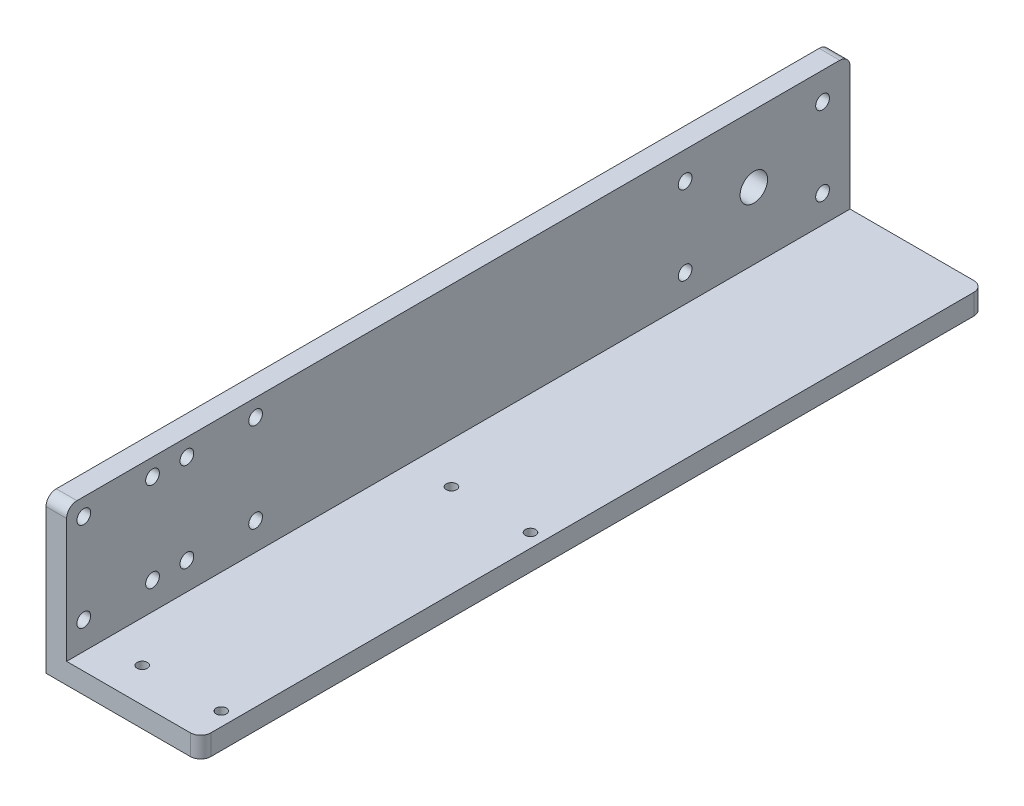
ISO-10303-21;
HEADER;
FILE_DESCRIPTION(('STEP AP214'),'2;1');
FILE_NAME('part.step','',(''),(''),'','','');
FILE_SCHEMA(('AUTOMOTIVE_DESIGN { 1 0 10303 214 1 1 1 1 }'));
ENDSEC;
DATA;
#1=APPLICATION_CONTEXT('core data for automotive mechanical design processes');
#2=APPLICATION_PROTOCOL_DEFINITION('international standard','automotive_design',2000,#1);
#3=PRODUCT_CONTEXT('',#1,'mechanical');
#4=PRODUCT('Part','Part','',(#3));
#5=PRODUCT_RELATED_PRODUCT_CATEGORY('part','',(#4));
#6=PRODUCT_DEFINITION_FORMATION('','',#4);
#7=PRODUCT_DEFINITION_CONTEXT('part definition',#1,'design');
#8=PRODUCT_DEFINITION('design','',#6,#7);
#9=PRODUCT_DEFINITION_SHAPE('','',#8);
#10=(LENGTH_UNIT() NAMED_UNIT(*) SI_UNIT(.MILLI.,.METRE.));
#11=(NAMED_UNIT(*) PLANE_ANGLE_UNIT() SI_UNIT($,.RADIAN.));
#12=(NAMED_UNIT(*) SI_UNIT($,.STERADIAN.) SOLID_ANGLE_UNIT());
#13=UNCERTAINTY_MEASURE_WITH_UNIT(LENGTH_MEASURE(1.E-05),#10,'distance_accuracy_value','');
#14=(GEOMETRIC_REPRESENTATION_CONTEXT(3) GLOBAL_UNCERTAINTY_ASSIGNED_CONTEXT((#13)) GLOBAL_UNIT_ASSIGNED_CONTEXT((#10,
#11,#12)) REPRESENTATION_CONTEXT('',''));
#15=CARTESIAN_POINT('',(0.,0.,0.));
#16=DIRECTION('',(0.,0.,1.));
#17=DIRECTION('',(1.,0.,0.));
#18=AXIS2_PLACEMENT_3D('',#15,#16,#17);
#19=CARTESIAN_POINT('',(76.9692086330936,26.8,228.));
#20=DIRECTION('',(0.,-1.,0.));
#21=DIRECTION('',(0.,0.,-1.));
#22=AXIS2_PLACEMENT_3D('',#19,#20,#21);
#23=PLANE('',#22);
#24=DIRECTION('',(0.,0.,-1.));
#25=VECTOR('',#24,1.);
#26=CARTESIAN_POINT('',(82.9692086330936,26.8,228.));
#27=LINE('',#26,#25);
#28=CARTESIAN_POINT('',(82.9692086330936,26.8,225.));
#29=VERTEX_POINT('',#28);
#30=CARTESIAN_POINT('',(82.9692086330936,26.8,3.00000000000006));
#31=VERTEX_POINT('',#30);
#32=EDGE_CURVE('E160',#29,#31,#27,.T.);
#33=ORIENTED_EDGE('',*,*,#32,.T.);
#34=DIRECTION('',(-1.,0.,0.));
#35=VECTOR('',#34,1.);
#36=CARTESIAN_POINT('',(76.9692086330936,26.8,3.));
#37=LINE('',#36,#35);
#38=CARTESIAN_POINT('',(76.9692086330936,26.8,3.00000000000006));
#39=VERTEX_POINT('',#38);
#40=EDGE_CURVE('E198',#31,#39,#37,.T.);
#41=ORIENTED_EDGE('',*,*,#40,.T.);
#42=DIRECTION('',(0.,0.,-1.));
#43=VECTOR('',#42,1.);
#44=CARTESIAN_POINT('',(76.9692086330936,26.8,228.));
#45=LINE('',#44,#43);
#46=CARTESIAN_POINT('',(76.9692086330936,26.8,225.));
#47=VERTEX_POINT('',#46);
#48=EDGE_CURVE('E146',#47,#39,#45,.T.);
#49=ORIENTED_EDGE('',*,*,#48,.F.);
#50=DIRECTION('',(-1.,0.,0.));
#51=VECTOR('',#50,1.);
#52=CARTESIAN_POINT('',(76.9692086330936,26.8,225.));
#53=LINE('',#52,#51);
#54=EDGE_CURVE('E66',#47,#29,#53,.F.);
#55=ORIENTED_EDGE('',*,*,#54,.T.);
#56=EDGE_LOOP('',(#33,#41,#49,#55));
#57=FACE_BOUND('',#56,.T.);
#58=ADVANCED_FACE('F44',(#57),#23,.F.);
#59=CARTESIAN_POINT('',(76.9692086330936,-12.2,228.));
#60=DIRECTION('',(1.,0.,0.));
#61=DIRECTION('',(0.,0.,-1.));
#62=AXIS2_PLACEMENT_3D('',#59,#60,#61);
#63=PLANE('',#62);
#64=CARTESIAN_POINT('',(76.9692086330936,7.30000000000002,28.));
#65=DIRECTION('',(-1.,0.,0.));
#66=DIRECTION('',(0.,-1.,0.));
#67=AXIS2_PLACEMENT_3D('',#64,#65,#66);
#68=CIRCLE('',#67,4.);
#69=CARTESIAN_POINT('',(76.9692086330936,3.30000000000002,28.));
#70=VERTEX_POINT('',#69);
#71=EDGE_CURVE('E430',#70,#70,#68,.T.);
#72=ORIENTED_EDGE('',*,*,#71,.F.);
#73=EDGE_LOOP('',(#72));
#74=FACE_BOUND('',#73,.T.);
#75=CARTESIAN_POINT('',(76.9692086330936,18.8,48.));
#76=DIRECTION('',(-1.,0.,0.));
#77=DIRECTION('',(0.,-1.,0.));
#78=AXIS2_PLACEMENT_3D('',#75,#76,#77);
#79=CIRCLE('',#78,2.);
#80=CARTESIAN_POINT('',(76.9692086330936,16.8,48.));
#81=VERTEX_POINT('',#80);
#82=EDGE_CURVE('E439',#81,#81,#79,.T.);
#83=ORIENTED_EDGE('',*,*,#82,.F.);
#84=EDGE_LOOP('',(#83));
#85=FACE_BOUND('',#84,.T.);
#86=CARTESIAN_POINT('',(76.9692086330936,-4.19999999999999,8.00000000000001));
#87=DIRECTION('',(-1.,0.,0.));
#88=DIRECTION('',(0.,-1.,0.));
#89=AXIS2_PLACEMENT_3D('',#86,#87,#88);
#90=CIRCLE('',#89,2.);
#91=CARTESIAN_POINT('',(76.9692086330936,-6.19999999999999,8.00000000000001));
#92=VERTEX_POINT('',#91);
#93=EDGE_CURVE('E438',#92,#92,#90,.T.);
#94=ORIENTED_EDGE('',*,*,#93,.F.);
#95=EDGE_LOOP('',(#94));
#96=FACE_BOUND('',#95,.T.);
#97=CARTESIAN_POINT('',(76.9692086330936,-4.19999999999999,48.));
#98=DIRECTION('',(-1.,0.,0.));
#99=DIRECTION('',(0.,-1.,0.));
#100=AXIS2_PLACEMENT_3D('',#97,#98,#99);
#101=CIRCLE('',#100,2.);
#102=CARTESIAN_POINT('',(76.9692086330936,-6.19999999999999,48.));
#103=VERTEX_POINT('',#102);
#104=EDGE_CURVE('E435',#103,#103,#101,.T.);
#105=ORIENTED_EDGE('',*,*,#104,.F.);
#106=EDGE_LOOP('',(#105));
#107=FACE_BOUND('',#106,.T.);
#108=CARTESIAN_POINT('',(76.9692086330936,18.8,8.00000000000001));
#109=DIRECTION('',(-1.,0.,0.));
#110=DIRECTION('',(0.,-1.,0.));
#111=AXIS2_PLACEMENT_3D('',#108,#109,#110);
#112=CIRCLE('',#111,2.);
#113=CARTESIAN_POINT('',(76.9692086330936,16.8,8.00000000000001));
#114=VERTEX_POINT('',#113);
#115=EDGE_CURVE('E236',#114,#114,#112,.T.);
#116=ORIENTED_EDGE('',*,*,#115,.F.);
#117=EDGE_LOOP('',(#116));
#118=FACE_BOUND('',#117,.T.);
#119=CARTESIAN_POINT('',(76.9692086330936,-4.19999999999999,173.));
#120=DIRECTION('',(1.,0.,0.));
#121=DIRECTION('',(0.,-1.,0.));
#122=AXIS2_PLACEMENT_3D('',#119,#120,#121);
#123=CIRCLE('',#122,2.);
#124=CARTESIAN_POINT('',(76.9692086330936,-6.19999999999998,173.));
#125=VERTEX_POINT('',#124);
#126=EDGE_CURVE('E252',#125,#125,#123,.T.);
#127=ORIENTED_EDGE('',*,*,#126,.T.);
#128=EDGE_LOOP('',(#127));
#129=FACE_BOUND('',#128,.T.);
#130=CARTESIAN_POINT('',(76.9692086330936,21.8,193.));
#131=DIRECTION('',(1.,0.,0.));
#132=DIRECTION('',(0.,-1.,0.));
#133=AXIS2_PLACEMENT_3D('',#130,#131,#132);
#134=CIRCLE('',#133,2.);
#135=CARTESIAN_POINT('',(76.9692086330936,19.8,193.));
#136=VERTEX_POINT('',#135);
#137=EDGE_CURVE('E247',#136,#136,#134,.T.);
#138=ORIENTED_EDGE('',*,*,#137,.T.);
#139=EDGE_LOOP('',(#138));
#140=FACE_BOUND('',#139,.T.);
#141=CARTESIAN_POINT('',(76.9692086330936,-4.19999999999999,193.));
#142=DIRECTION('',(1.,0.,0.));
#143=DIRECTION('',(0.,-1.,0.));
#144=AXIS2_PLACEMENT_3D('',#141,#142,#143);
#145=CIRCLE('',#144,2.);
#146=CARTESIAN_POINT('',(76.9692086330936,-6.19999999999998,193.));
#147=VERTEX_POINT('',#146);
#148=EDGE_CURVE('E243',#147,#147,#145,.T.);
#149=ORIENTED_EDGE('',*,*,#148,.T.);
#150=EDGE_LOOP('',(#149));
#151=FACE_BOUND('',#150,.T.);
#152=CARTESIAN_POINT('',(76.9692086330936,21.8,173.));
#153=DIRECTION('',(1.,0.,0.));
#154=DIRECTION('',(0.,-1.,0.));
#155=AXIS2_PLACEMENT_3D('',#152,#153,#154);
#156=CIRCLE('',#155,2.);
#157=CARTESIAN_POINT('',(76.9692086330936,19.8,173.));
#158=VERTEX_POINT('',#157);
#159=EDGE_CURVE('E222',#158,#158,#156,.T.);
#160=ORIENTED_EDGE('',*,*,#159,.T.);
#161=EDGE_LOOP('',(#160));
#162=FACE_BOUND('',#161,.T.);
#163=CARTESIAN_POINT('',(76.9692086330936,-4.19999999999999,223.));
#164=DIRECTION('',(-1.,0.,0.));
#165=DIRECTION('',(0.,-1.,0.));
#166=AXIS2_PLACEMENT_3D('',#163,#164,#165);
#167=CIRCLE('',#166,2.);
#168=CARTESIAN_POINT('',(76.9692086330936,-6.19999999999998,223.));
#169=VERTEX_POINT('',#168);
#170=EDGE_CURVE('E264',#169,#169,#167,.T.);
#171=ORIENTED_EDGE('',*,*,#170,.F.);
#172=EDGE_LOOP('',(#171));
#173=FACE_BOUND('',#172,.T.);
#174=CARTESIAN_POINT('',(76.9692086330936,21.8,203.));
#175=DIRECTION('',(-1.,0.,0.));
#176=DIRECTION('',(0.,-1.,0.));
#177=AXIS2_PLACEMENT_3D('',#174,#175,#176);
#178=CIRCLE('',#177,2.);
#179=CARTESIAN_POINT('',(76.9692086330936,19.8,203.));
#180=VERTEX_POINT('',#179);
#181=EDGE_CURVE('E263',#180,#180,#178,.T.);
#182=ORIENTED_EDGE('',*,*,#181,.F.);
#183=EDGE_LOOP('',(#182));
#184=FACE_BOUND('',#183,.T.);
#185=CARTESIAN_POINT('',(76.9692086330936,-4.19999999999999,203.));
#186=DIRECTION('',(-1.,0.,0.));
#187=DIRECTION('',(0.,-1.,0.));
#188=AXIS2_PLACEMENT_3D('',#185,#186,#187);
#189=CIRCLE('',#188,2.);
#190=CARTESIAN_POINT('',(76.9692086330936,-6.19999999999998,203.));
#191=VERTEX_POINT('',#190);
#192=EDGE_CURVE('E231',#191,#191,#189,.T.);
#193=ORIENTED_EDGE('',*,*,#192,.F.);
#194=EDGE_LOOP('',(#193));
#195=FACE_BOUND('',#194,.T.);
#196=CARTESIAN_POINT('',(76.9692086330936,21.8,223.));
#197=DIRECTION('',(-1.,0.,0.));
#198=DIRECTION('',(0.,-1.,0.));
#199=AXIS2_PLACEMENT_3D('',#196,#197,#198);
#200=CIRCLE('',#199,2.);
#201=CARTESIAN_POINT('',(76.9692086330936,19.8,223.));
#202=VERTEX_POINT('',#201);
#203=EDGE_CURVE('E210',#202,#202,#200,.T.);
#204=ORIENTED_EDGE('',*,*,#203,.F.);
#205=EDGE_LOOP('',(#204));
#206=FACE_BOUND('',#205,.T.);
#207=ORIENTED_EDGE('',*,*,#48,.T.);
#208=CARTESIAN_POINT('',(76.9692086330936,23.8,3.));
#209=DIRECTION('',(1.,0.,0.));
#210=DIRECTION('',(0.,0.,-1.));
#211=AXIS2_PLACEMENT_3D('',#208,#209,#210);
#212=CIRCLE('',#211,3.);
#213=CARTESIAN_POINT('',(76.9692086330936,23.8,0.));
#214=VERTEX_POINT('',#213);
#215=EDGE_CURVE('E203',#39,#214,#212,.F.);
#216=ORIENTED_EDGE('',*,*,#215,.T.);
#217=DIRECTION('',(0.,-1.,0.));
#218=VECTOR('',#217,1.);
#219=CARTESIAN_POINT('',(76.9692086330936,-12.2,0.));
#220=LINE('',#219,#218);
#221=CARTESIAN_POINT('',(76.9692086330936,-18.2,0.));
#222=VERTEX_POINT('',#221);
#223=EDGE_CURVE('E142',#214,#222,#220,.T.);
#224=ORIENTED_EDGE('',*,*,#223,.T.);
#225=DIRECTION('',(0.,0.,-1.));
#226=VECTOR('',#225,1.);
#227=CARTESIAN_POINT('',(76.9692086330936,-18.2,228.));
#228=LINE('',#227,#226);
#229=CARTESIAN_POINT('',(76.9692086330936,-18.2,228.));
#230=VERTEX_POINT('',#229);
#231=EDGE_CURVE('E138',#230,#222,#228,.T.);
#232=ORIENTED_EDGE('',*,*,#231,.F.);
#233=DIRECTION('',(0.,-1.,0.));
#234=VECTOR('',#233,1.);
#235=CARTESIAN_POINT('',(76.9692086330936,-12.2,228.));
#236=LINE('',#235,#234);
#237=CARTESIAN_POINT('',(76.9692086330936,23.8,228.));
#238=VERTEX_POINT('',#237);
#239=EDGE_CURVE('E124',#238,#230,#236,.T.);
#240=ORIENTED_EDGE('',*,*,#239,.F.);
#241=CARTESIAN_POINT('',(76.9692086330936,23.8,225.));
#242=DIRECTION('',(1.,0.,0.));
#243=DIRECTION('',(0.,0.,-1.));
#244=AXIS2_PLACEMENT_3D('',#241,#242,#243);
#245=CIRCLE('',#244,3.);
#246=EDGE_CURVE('E201',#238,#47,#245,.F.);
#247=ORIENTED_EDGE('',*,*,#246,.T.);
#248=EDGE_LOOP('',(#207,#216,#224,#232,#240,#247));
#249=FACE_BOUND('',#248,.T.);
#250=ADVANCED_FACE('F140',(#74,#85,#96,#107,#118,#129,#140,#151,#162,#173,#184,#195,#206,#249),
#63,.F.);
#251=CARTESIAN_POINT('',(82.9692086330936,-18.2,228.));
#252=DIRECTION('',(0.,1.,0.));
#253=DIRECTION('',(0.,0.,1.));
#254=AXIS2_PLACEMENT_3D('',#251,#252,#253);
#255=PLANE('',#254);
#256=CARTESIAN_POINT('',(94.9692086330936,-18.2,128.));
#257=DIRECTION('',(0.,1.,0.));
#258=DIRECTION('',(-1.,0.,0.));
#259=AXIS2_PLACEMENT_3D('',#256,#257,#258);
#260=CIRCLE('',#259,1.5);
#261=CARTESIAN_POINT('',(93.4692086330936,-18.2,128.));
#262=VERTEX_POINT('',#261);
#263=EDGE_CURVE('E421',#262,#262,#260,.T.);
#264=ORIENTED_EDGE('',*,*,#263,.T.);
#265=EDGE_LOOP('',(#264));
#266=FACE_BOUND('',#265,.T.);
#267=CARTESIAN_POINT('',(117.969208633094,-18.2,128.));
#268=DIRECTION('',(0.,1.,0.));
#269=DIRECTION('',(-1.,0.,0.));
#270=AXIS2_PLACEMENT_3D('',#267,#268,#269);
#271=CIRCLE('',#270,1.5);
#272=CARTESIAN_POINT('',(116.469208633094,-18.2,128.));
#273=VERTEX_POINT('',#272);
#274=EDGE_CURVE('E411',#273,#273,#271,.T.);
#275=ORIENTED_EDGE('',*,*,#274,.T.);
#276=EDGE_LOOP('',(#275));
#277=FACE_BOUND('',#276,.T.);
#278=CARTESIAN_POINT('',(117.969208633094,-18.2,218.));
#279=DIRECTION('',(0.,1.,0.));
#280=DIRECTION('',(-1.,0.,0.));
#281=AXIS2_PLACEMENT_3D('',#278,#279,#280);
#282=CIRCLE('',#281,1.5);
#283=CARTESIAN_POINT('',(116.469208633094,-18.2,218.));
#284=VERTEX_POINT('',#283);
#285=EDGE_CURVE('E406',#284,#284,#282,.T.);
#286=ORIENTED_EDGE('',*,*,#285,.T.);
#287=EDGE_LOOP('',(#286));
#288=FACE_BOUND('',#287,.T.);
#289=CARTESIAN_POINT('',(94.9692086330936,-18.2,218.));
#290=DIRECTION('',(0.,1.,0.));
#291=DIRECTION('',(-1.,0.,0.));
#292=AXIS2_PLACEMENT_3D('',#289,#290,#291);
#293=CIRCLE('',#292,1.5);
#294=CARTESIAN_POINT('',(93.4692086330936,-18.2,218.));
#295=VERTEX_POINT('',#294);
#296=EDGE_CURVE('E427',#295,#295,#293,.T.);
#297=ORIENTED_EDGE('',*,*,#296,.T.);
#298=EDGE_LOOP('',(#297));
#299=FACE_BOUND('',#298,.T.);
#300=DIRECTION('',(1.,0.,0.));
#301=VECTOR('',#300,1.);
#302=CARTESIAN_POINT('',(82.9692086330936,-18.2,0.));
#303=LINE('',#302,#301);
#304=CARTESIAN_POINT('',(118.969208633094,-18.2,0.));
#305=VERTEX_POINT('',#304);
#306=EDGE_CURVE('E162',#222,#305,#303,.T.);
#307=ORIENTED_EDGE('',*,*,#306,.T.);
#308=CARTESIAN_POINT('',(118.969208633094,-18.2,3.));
#309=DIRECTION('',(0.,1.,0.));
#310=DIRECTION('',(0.,0.,1.));
#311=AXIS2_PLACEMENT_3D('',#308,#309,#310);
#312=CIRCLE('',#311,3.);
#313=CARTESIAN_POINT('',(121.969208633094,-18.2,3.00000000000006));
#314=VERTEX_POINT('',#313);
#315=EDGE_CURVE('E192',#305,#314,#312,.F.);
#316=ORIENTED_EDGE('',*,*,#315,.T.);
#317=DIRECTION('',(0.,0.,-1.));
#318=VECTOR('',#317,1.);
#319=CARTESIAN_POINT('',(121.969208633094,-18.2,228.));
#320=LINE('',#319,#318);
#321=CARTESIAN_POINT('',(121.969208633094,-18.2,225.));
#322=VERTEX_POINT('',#321);
#323=EDGE_CURVE('E147',#322,#314,#320,.T.);
#324=ORIENTED_EDGE('',*,*,#323,.F.);
#325=CARTESIAN_POINT('',(118.969208633094,-18.2,225.));
#326=DIRECTION('',(0.,1.,0.));
#327=DIRECTION('',(0.,0.,1.));
#328=AXIS2_PLACEMENT_3D('',#325,#326,#327);
#329=CIRCLE('',#328,3.);
#330=CARTESIAN_POINT('',(118.969208633094,-18.2,228.));
#331=VERTEX_POINT('',#330);
#332=EDGE_CURVE('E152',#322,#331,#329,.F.);
#333=ORIENTED_EDGE('',*,*,#332,.T.);
#334=DIRECTION('',(1.,0.,0.));
#335=VECTOR('',#334,1.);
#336=CARTESIAN_POINT('',(82.9692086330936,-18.2,228.));
#337=LINE('',#336,#335);
#338=EDGE_CURVE('E129',#230,#331,#337,.T.);
#339=ORIENTED_EDGE('',*,*,#338,.F.);
#340=ORIENTED_EDGE('',*,*,#231,.T.);
#341=EDGE_LOOP('',(#307,#316,#324,#333,#339,#340));
#342=FACE_BOUND('',#341,.T.);
#343=ADVANCED_FACE('F149',(#266,#277,#288,#299,#342),#255,.F.);
#344=CARTESIAN_POINT('',(121.969208633094,-18.2,228.));
#345=DIRECTION('',(-1.,0.,0.));
#346=DIRECTION('',(0.,0.,1.));
#347=AXIS2_PLACEMENT_3D('',#344,#345,#346);
#348=PLANE('',#347);
#349=ORIENTED_EDGE('',*,*,#323,.T.);
#350=DIRECTION('',(0.,1.,0.));
#351=VECTOR('',#350,1.);
#352=CARTESIAN_POINT('',(121.969208633094,-12.2,3.));
#353=LINE('',#352,#351);
#354=CARTESIAN_POINT('',(121.969208633094,-12.2,3.00000000000006));
#355=VERTEX_POINT('',#354);
#356=EDGE_CURVE('E180',#314,#355,#353,.T.);
#357=ORIENTED_EDGE('',*,*,#356,.T.);
#358=DIRECTION('',(0.,0.,-1.));
#359=VECTOR('',#358,1.);
#360=CARTESIAN_POINT('',(121.969208633094,-12.2,228.));
#361=LINE('',#360,#359);
#362=CARTESIAN_POINT('',(121.969208633094,-12.2,225.));
#363=VERTEX_POINT('',#362);
#364=EDGE_CURVE('E172',#363,#355,#361,.T.);
#365=ORIENTED_EDGE('',*,*,#364,.F.);
#366=DIRECTION('',(0.,1.,0.));
#367=VECTOR('',#366,1.);
#368=CARTESIAN_POINT('',(121.969208633094,-18.2,225.));
#369=LINE('',#368,#367);
#370=EDGE_CURVE('E178',#363,#322,#369,.F.);
#371=ORIENTED_EDGE('',*,*,#370,.T.);
#372=EDGE_LOOP('',(#349,#357,#365,#371));
#373=FACE_BOUND('',#372,.T.);
#374=ADVANCED_FACE('F281',(#373),#348,.F.);
#375=CARTESIAN_POINT('',(82.9692086330936,-12.2,228.));
#376=DIRECTION('',(0.,-1.,0.));
#377=DIRECTION('',(1.,0.,0.));
#378=AXIS2_PLACEMENT_3D('',#375,#376,#377);
#379=PLANE('',#378);
#380=CARTESIAN_POINT('',(94.9692086330936,-12.2,128.));
#381=DIRECTION('',(0.,1.,0.));
#382=DIRECTION('',(-1.,0.,0.));
#383=AXIS2_PLACEMENT_3D('',#380,#381,#382);
#384=CIRCLE('',#383,1.5);
#385=CARTESIAN_POINT('',(93.4692086330936,-12.2,128.));
#386=VERTEX_POINT('',#385);
#387=EDGE_CURVE('E424',#386,#386,#384,.T.);
#388=ORIENTED_EDGE('',*,*,#387,.F.);
#389=EDGE_LOOP('',(#388));
#390=FACE_BOUND('',#389,.T.);
#391=CARTESIAN_POINT('',(117.969208633094,-12.2,128.));
#392=DIRECTION('',(0.,1.,0.));
#393=DIRECTION('',(-1.,0.,0.));
#394=AXIS2_PLACEMENT_3D('',#391,#392,#393);
#395=CIRCLE('',#394,1.5);
#396=CARTESIAN_POINT('',(116.469208633094,-12.2,128.));
#397=VERTEX_POINT('',#396);
#398=EDGE_CURVE('E416',#397,#397,#395,.T.);
#399=ORIENTED_EDGE('',*,*,#398,.F.);
#400=EDGE_LOOP('',(#399));
#401=FACE_BOUND('',#400,.T.);
#402=CARTESIAN_POINT('',(117.969208633094,-12.2,218.));
#403=DIRECTION('',(0.,1.,0.));
#404=DIRECTION('',(-1.,0.,0.));
#405=AXIS2_PLACEMENT_3D('',#402,#403,#404);
#406=CIRCLE('',#405,1.5);
#407=CARTESIAN_POINT('',(116.469208633094,-12.2,218.));
#408=VERTEX_POINT('',#407);
#409=EDGE_CURVE('E409',#408,#408,#406,.T.);
#410=ORIENTED_EDGE('',*,*,#409,.F.);
#411=EDGE_LOOP('',(#410));
#412=FACE_BOUND('',#411,.T.);
#413=CARTESIAN_POINT('',(94.9692086330936,-12.2,218.));
#414=DIRECTION('',(0.,1.,0.));
#415=DIRECTION('',(-1.,0.,0.));
#416=AXIS2_PLACEMENT_3D('',#413,#414,#415);
#417=CIRCLE('',#416,1.5);
#418=CARTESIAN_POINT('',(93.4692086330936,-12.2,218.));
#419=VERTEX_POINT('',#418);
#420=EDGE_CURVE('E413',#419,#419,#417,.T.);
#421=ORIENTED_EDGE('',*,*,#420,.F.);
#422=EDGE_LOOP('',(#421));
#423=FACE_BOUND('',#422,.T.);
#424=ORIENTED_EDGE('',*,*,#364,.T.);
#425=CARTESIAN_POINT('',(118.969208633094,-12.2,3.));
#426=DIRECTION('',(0.,-1.,0.));
#427=DIRECTION('',(1.,0.,0.));
#428=AXIS2_PLACEMENT_3D('',#425,#426,#427);
#429=CIRCLE('',#428,3.);
#430=CARTESIAN_POINT('',(118.969208633094,-12.2,0.));
#431=VERTEX_POINT('',#430);
#432=EDGE_CURVE('E185',#355,#431,#429,.F.);
#433=ORIENTED_EDGE('',*,*,#432,.T.);
#434=DIRECTION('',(-1.,0.,0.));
#435=VECTOR('',#434,1.);
#436=CARTESIAN_POINT('',(82.9692086330936,-12.2,0.));
#437=LINE('',#436,#435);
#438=CARTESIAN_POINT('',(82.9692086330936,-12.2,0.));
#439=VERTEX_POINT('',#438);
#440=EDGE_CURVE('E165',#431,#439,#437,.T.);
#441=ORIENTED_EDGE('',*,*,#440,.T.);
#442=DIRECTION('',(0.,0.,-1.));
#443=VECTOR('',#442,1.);
#444=CARTESIAN_POINT('',(82.9692086330936,-12.2,228.));
#445=LINE('',#444,#443);
#446=CARTESIAN_POINT('',(82.9692086330936,-12.2,228.));
#447=VERTEX_POINT('',#446);
#448=EDGE_CURVE('E169',#447,#439,#445,.T.);
#449=ORIENTED_EDGE('',*,*,#448,.F.);
#450=DIRECTION('',(-1.,0.,0.));
#451=VECTOR('',#450,1.);
#452=CARTESIAN_POINT('',(82.9692086330936,-12.2,228.));
#453=LINE('',#452,#451);
#454=CARTESIAN_POINT('',(118.969208633094,-12.2,228.));
#455=VERTEX_POINT('',#454);
#456=EDGE_CURVE('E153',#455,#447,#453,.T.);
#457=ORIENTED_EDGE('',*,*,#456,.F.);
#458=CARTESIAN_POINT('',(118.969208633094,-12.2,225.));
#459=DIRECTION('',(0.,-1.,0.));
#460=DIRECTION('',(1.,0.,0.));
#461=AXIS2_PLACEMENT_3D('',#458,#459,#460);
#462=CIRCLE('',#461,3.);
#463=EDGE_CURVE('E183',#455,#363,#462,.F.);
#464=ORIENTED_EDGE('',*,*,#463,.T.);
#465=EDGE_LOOP('',(#424,#433,#441,#449,#457,#464));
#466=FACE_BOUND('',#465,.T.);
#467=ADVANCED_FACE('F312',(#390,#401,#412,#423,#466),#379,.F.);
#468=CARTESIAN_POINT('',(82.9692086330936,26.8,228.));
#469=DIRECTION('',(-1.,0.,0.));
#470=DIRECTION('',(0.,0.,1.));
#471=AXIS2_PLACEMENT_3D('',#468,#469,#470);
#472=PLANE('',#471);
#473=CARTESIAN_POINT('',(82.9692086330936,7.30000000000002,28.));
#474=DIRECTION('',(-1.,0.,0.));
#475=DIRECTION('',(0.,0.,1.));
#476=AXIS2_PLACEMENT_3D('',#473,#474,#475);
#477=CIRCLE('',#476,4.);
#478=CARTESIAN_POINT('',(82.9692086330936,7.30000000000002,32.));
#479=VERTEX_POINT('',#478);
#480=EDGE_CURVE('E48',#479,#479,#477,.T.);
#481=ORIENTED_EDGE('',*,*,#480,.T.);
#482=EDGE_LOOP('',(#481));
#483=FACE_BOUND('',#482,.T.);
#484=CARTESIAN_POINT('',(82.9692086330936,18.8,48.));
#485=DIRECTION('',(-1.,0.,0.));
#486=DIRECTION('',(0.,0.,1.));
#487=AXIS2_PLACEMENT_3D('',#484,#485,#486);
#488=CIRCLE('',#487,2.);
#489=CARTESIAN_POINT('',(82.9692086330936,18.8,50.));
#490=VERTEX_POINT('',#489);
#491=EDGE_CURVE('E241',#490,#490,#488,.T.);
#492=ORIENTED_EDGE('',*,*,#491,.T.);
#493=EDGE_LOOP('',(#492));
#494=FACE_BOUND('',#493,.T.);
#495=CARTESIAN_POINT('',(82.9692086330936,-4.19999999999999,8.00000000000001));
#496=DIRECTION('',(-1.,0.,0.));
#497=DIRECTION('',(0.,0.,1.));
#498=AXIS2_PLACEMENT_3D('',#495,#496,#497);
#499=CIRCLE('',#498,2.);
#500=CARTESIAN_POINT('',(82.9692086330936,-4.19999999999999,10.));
#501=VERTEX_POINT('',#500);
#502=EDGE_CURVE('E239',#501,#501,#499,.T.);
#503=ORIENTED_EDGE('',*,*,#502,.T.);
#504=EDGE_LOOP('',(#503));
#505=FACE_BOUND('',#504,.T.);
#506=CARTESIAN_POINT('',(82.9692086330936,-4.19999999999999,48.));
#507=DIRECTION('',(-1.,0.,0.));
#508=DIRECTION('',(0.,0.,1.));
#509=AXIS2_PLACEMENT_3D('',#506,#507,#508);
#510=CIRCLE('',#509,2.);
#511=CARTESIAN_POINT('',(82.9692086330936,-4.19999999999999,50.));
#512=VERTEX_POINT('',#511);
#513=EDGE_CURVE('E235',#512,#512,#510,.T.);
#514=ORIENTED_EDGE('',*,*,#513,.T.);
#515=EDGE_LOOP('',(#514));
#516=FACE_BOUND('',#515,.T.);
#517=CARTESIAN_POINT('',(82.9692086330936,18.8,8.00000000000001));
#518=DIRECTION('',(-1.,0.,0.));
#519=DIRECTION('',(0.,0.,1.));
#520=AXIS2_PLACEMENT_3D('',#517,#518,#519);
#521=CIRCLE('',#520,2.);
#522=CARTESIAN_POINT('',(82.9692086330936,18.8,10.));
#523=VERTEX_POINT('',#522);
#524=EDGE_CURVE('E232',#523,#523,#521,.T.);
#525=ORIENTED_EDGE('',*,*,#524,.T.);
#526=EDGE_LOOP('',(#525));
#527=FACE_BOUND('',#526,.T.);
#528=CARTESIAN_POINT('',(82.9692086330936,-4.19999999999999,173.));
#529=DIRECTION('',(-1.,0.,0.));
#530=DIRECTION('',(0.,0.,1.));
#531=AXIS2_PLACEMENT_3D('',#528,#529,#530);
#532=CIRCLE('',#531,2.);
#533=CARTESIAN_POINT('',(82.9692086330936,-4.19999999999999,175.));
#534=VERTEX_POINT('',#533);
#535=EDGE_CURVE('E228',#534,#534,#532,.F.);
#536=ORIENTED_EDGE('',*,*,#535,.F.);
#537=EDGE_LOOP('',(#536));
#538=FACE_BOUND('',#537,.T.);
#539=CARTESIAN_POINT('',(82.9692086330936,21.8,193.));
#540=DIRECTION('',(-1.,0.,0.));
#541=DIRECTION('',(0.,0.,1.));
#542=AXIS2_PLACEMENT_3D('',#539,#540,#541);
#543=CIRCLE('',#542,2.);
#544=CARTESIAN_POINT('',(82.9692086330936,21.8,195.));
#545=VERTEX_POINT('',#544);
#546=EDGE_CURVE('E225',#545,#545,#543,.F.);
#547=ORIENTED_EDGE('',*,*,#546,.F.);
#548=EDGE_LOOP('',(#547));
#549=FACE_BOUND('',#548,.T.);
#550=CARTESIAN_POINT('',(82.9692086330936,-4.19999999999999,193.));
#551=DIRECTION('',(-1.,0.,0.));
#552=DIRECTION('',(0.,0.,1.));
#553=AXIS2_PLACEMENT_3D('',#550,#551,#552);
#554=CIRCLE('',#553,2.);
#555=CARTESIAN_POINT('',(82.9692086330936,-4.19999999999999,195.));
#556=VERTEX_POINT('',#555);
#557=EDGE_CURVE('E221',#556,#556,#554,.F.);
#558=ORIENTED_EDGE('',*,*,#557,.F.);
#559=EDGE_LOOP('',(#558));
#560=FACE_BOUND('',#559,.T.);
#561=CARTESIAN_POINT('',(82.9692086330936,21.8,173.));
#562=DIRECTION('',(-1.,0.,0.));
#563=DIRECTION('',(0.,0.,1.));
#564=AXIS2_PLACEMENT_3D('',#561,#562,#563);
#565=CIRCLE('',#564,2.);
#566=CARTESIAN_POINT('',(82.9692086330936,21.8,175.));
#567=VERTEX_POINT('',#566);
#568=EDGE_CURVE('E218',#567,#567,#565,.F.);
#569=ORIENTED_EDGE('',*,*,#568,.F.);
#570=EDGE_LOOP('',(#569));
#571=FACE_BOUND('',#570,.T.);
#572=CARTESIAN_POINT('',(82.9692086330936,-4.19999999999999,223.));
#573=DIRECTION('',(-1.,0.,0.));
#574=DIRECTION('',(0.,0.,1.));
#575=AXIS2_PLACEMENT_3D('',#572,#573,#574);
#576=CIRCLE('',#575,2.);
#577=CARTESIAN_POINT('',(82.9692086330936,-4.19999999999999,225.));
#578=VERTEX_POINT('',#577);
#579=EDGE_CURVE('E163',#578,#578,#576,.T.);
#580=ORIENTED_EDGE('',*,*,#579,.T.);
#581=EDGE_LOOP('',(#580));
#582=FACE_BOUND('',#581,.T.);
#583=CARTESIAN_POINT('',(82.9692086330936,21.8,203.));
#584=DIRECTION('',(-1.,0.,0.));
#585=DIRECTION('',(0.,0.,1.));
#586=AXIS2_PLACEMENT_3D('',#583,#584,#585);
#587=CIRCLE('',#586,2.);
#588=CARTESIAN_POINT('',(82.9692086330936,21.8,205.));
#589=VERTEX_POINT('',#588);
#590=EDGE_CURVE('E213',#589,#589,#587,.T.);
#591=ORIENTED_EDGE('',*,*,#590,.T.);
#592=EDGE_LOOP('',(#591));
#593=FACE_BOUND('',#592,.T.);
#594=CARTESIAN_POINT('',(82.9692086330936,-4.19999999999999,203.));
#595=DIRECTION('',(-1.,0.,0.));
#596=DIRECTION('',(0.,0.,1.));
#597=AXIS2_PLACEMENT_3D('',#594,#595,#596);
#598=CIRCLE('',#597,2.);
#599=CARTESIAN_POINT('',(82.9692086330936,-4.19999999999999,205.));
#600=VERTEX_POINT('',#599);
#601=EDGE_CURVE('E209',#600,#600,#598,.T.);
#602=ORIENTED_EDGE('',*,*,#601,.T.);
#603=EDGE_LOOP('',(#602));
#604=FACE_BOUND('',#603,.T.);
#605=CARTESIAN_POINT('',(82.9692086330936,21.8,223.));
#606=DIRECTION('',(-1.,0.,0.));
#607=DIRECTION('',(0.,0.,1.));
#608=AXIS2_PLACEMENT_3D('',#605,#606,#607);
#609=CIRCLE('',#608,2.);
#610=CARTESIAN_POINT('',(82.9692086330936,21.8,225.));
#611=VERTEX_POINT('',#610);
#612=EDGE_CURVE('E206',#611,#611,#609,.T.);
#613=ORIENTED_EDGE('',*,*,#612,.T.);
#614=EDGE_LOOP('',(#613));
#615=FACE_BOUND('',#614,.T.);
#616=DIRECTION('',(0.,1.,0.));
#617=VECTOR('',#616,1.);
#618=CARTESIAN_POINT('',(82.9692086330936,26.8,0.));
#619=LINE('',#618,#617);
#620=CARTESIAN_POINT('',(82.9692086330936,23.8,0.));
#621=VERTEX_POINT('',#620);
#622=EDGE_CURVE('E135',#439,#621,#619,.T.);
#623=ORIENTED_EDGE('',*,*,#622,.T.);
#624=CARTESIAN_POINT('',(82.9692086330936,23.8,3.));
#625=DIRECTION('',(-1.,0.,0.));
#626=DIRECTION('',(0.,0.,1.));
#627=AXIS2_PLACEMENT_3D('',#624,#625,#626);
#628=CIRCLE('',#627,3.);
#629=EDGE_CURVE('E13',#621,#31,#628,.F.);
#630=ORIENTED_EDGE('',*,*,#629,.T.);
#631=ORIENTED_EDGE('',*,*,#32,.F.);
#632=CARTESIAN_POINT('',(82.9692086330936,23.8,225.));
#633=DIRECTION('',(-1.,0.,0.));
#634=DIRECTION('',(0.,0.,1.));
#635=AXIS2_PLACEMENT_3D('',#632,#633,#634);
#636=CIRCLE('',#635,3.);
#637=CARTESIAN_POINT('',(82.9692086330936,23.8,228.));
#638=VERTEX_POINT('',#637);
#639=EDGE_CURVE('E53',#29,#638,#636,.F.);
#640=ORIENTED_EDGE('',*,*,#639,.T.);
#641=DIRECTION('',(0.,1.,0.));
#642=VECTOR('',#641,1.);
#643=CARTESIAN_POINT('',(82.9692086330936,26.8,228.));
#644=LINE('',#643,#642);
#645=EDGE_CURVE('E155',#447,#638,#644,.T.);
#646=ORIENTED_EDGE('',*,*,#645,.F.);
#647=ORIENTED_EDGE('',*,*,#448,.T.);
#648=EDGE_LOOP('',(#623,#630,#631,#640,#646,#647));
#649=FACE_BOUND('',#648,.T.);
#650=ADVANCED_FACE('F308',(#483,#494,#505,#516,#527,#538,#549,#560,#571,#582,#593,#604,#615,
#649),#472,.F.);
#651=CARTESIAN_POINT('',(0.,0.,228.));
#652=DIRECTION('',(0.,0.,-1.));
#653=DIRECTION('',(-1.,0.,0.));
#654=AXIS2_PLACEMENT_3D('',#651,#652,#653);
#655=PLANE('',#654);
#656=ORIENTED_EDGE('',*,*,#338,.T.);
#657=DIRECTION('',(0.,1.,0.));
#658=VECTOR('',#657,1.);
#659=CARTESIAN_POINT('',(118.969208633094,0.,228.));
#660=LINE('',#659,#658);
#661=EDGE_CURVE('E195',#331,#455,#660,.T.);
#662=ORIENTED_EDGE('',*,*,#661,.T.);
#663=ORIENTED_EDGE('',*,*,#456,.T.);
#664=ORIENTED_EDGE('',*,*,#645,.T.);
#665=DIRECTION('',(-1.,0.,0.));
#666=VECTOR('',#665,1.);
#667=CARTESIAN_POINT('',(0.,23.8,228.));
#668=LINE('',#667,#666);
#669=EDGE_CURVE('E133',#638,#238,#668,.T.);
#670=ORIENTED_EDGE('',*,*,#669,.T.);
#671=ORIENTED_EDGE('',*,*,#239,.T.);
#672=EDGE_LOOP('',(#656,#662,#663,#664,#670,#671));
#673=FACE_BOUND('',#672,.T.);
#674=ADVANCED_FACE('F126',(#673),#655,.F.);
#675=CARTESIAN_POINT('',(0.,0.,0.));
#676=DIRECTION('',(0.,0.,-1.));
#677=DIRECTION('',(-1.,0.,0.));
#678=AXIS2_PLACEMENT_3D('',#675,#676,#677);
#679=PLANE('',#678);
#680=ORIENTED_EDGE('',*,*,#440,.F.);
#681=DIRECTION('',(0.,1.,0.));
#682=VECTOR('',#681,1.);
#683=CARTESIAN_POINT('',(118.969208633094,-18.2,0.));
#684=LINE('',#683,#682);
#685=EDGE_CURVE('E189',#431,#305,#684,.F.);
#686=ORIENTED_EDGE('',*,*,#685,.T.);
#687=ORIENTED_EDGE('',*,*,#306,.F.);
#688=ORIENTED_EDGE('',*,*,#223,.F.);
#689=DIRECTION('',(-1.,0.,0.));
#690=VECTOR('',#689,1.);
#691=CARTESIAN_POINT('',(82.9692086330936,23.8,0.));
#692=LINE('',#691,#690);
#693=EDGE_CURVE('E187',#214,#621,#692,.F.);
#694=ORIENTED_EDGE('',*,*,#693,.T.);
#695=ORIENTED_EDGE('',*,*,#622,.F.);
#696=EDGE_LOOP('',(#680,#686,#687,#688,#694,#695));
#697=FACE_BOUND('',#696,.T.);
#698=ADVANCED_FACE('F293',(#697),#679,.T.);
#699=CARTESIAN_POINT('',(118.969208633094,-18.2,3.));
#700=DIRECTION('',(0.,-1.,0.));
#701=DIRECTION('',(0.,0.,-1.));
#702=AXIS2_PLACEMENT_3D('',#699,#700,#701);
#703=CYLINDRICAL_SURFACE('',#702,3.);
#704=ORIENTED_EDGE('',*,*,#315,.F.);
#705=ORIENTED_EDGE('',*,*,#685,.F.);
#706=ORIENTED_EDGE('',*,*,#432,.F.);
#707=ORIENTED_EDGE('',*,*,#356,.F.);
#708=EDGE_LOOP('',(#704,#705,#706,#707));
#709=FACE_BOUND('',#708,.T.);
#710=ADVANCED_FACE('F289',(#709),#703,.T.);
#711=CARTESIAN_POINT('',(118.969208633094,0.,225.));
#712=DIRECTION('',(0.,1.,0.));
#713=DIRECTION('',(0.,0.,1.));
#714=AXIS2_PLACEMENT_3D('',#711,#712,#713);
#715=CYLINDRICAL_SURFACE('',#714,3.);
#716=ORIENTED_EDGE('',*,*,#332,.F.);
#717=ORIENTED_EDGE('',*,*,#370,.F.);
#718=ORIENTED_EDGE('',*,*,#463,.F.);
#719=ORIENTED_EDGE('',*,*,#661,.F.);
#720=EDGE_LOOP('',(#716,#717,#718,#719));
#721=FACE_BOUND('',#720,.T.);
#722=ADVANCED_FACE('F292',(#721),#715,.T.);
#723=CARTESIAN_POINT('',(76.9692086330936,23.8,3.));
#724=DIRECTION('',(1.,0.,0.));
#725=DIRECTION('',(0.,0.,-1.));
#726=AXIS2_PLACEMENT_3D('',#723,#724,#725);
#727=CYLINDRICAL_SURFACE('',#726,3.);
#728=ORIENTED_EDGE('',*,*,#629,.F.);
#729=ORIENTED_EDGE('',*,*,#693,.F.);
#730=ORIENTED_EDGE('',*,*,#215,.F.);
#731=ORIENTED_EDGE('',*,*,#40,.F.);
#732=EDGE_LOOP('',(#728,#729,#730,#731));
#733=FACE_BOUND('',#732,.T.);
#734=ADVANCED_FACE('F296',(#733),#727,.T.);
#735=CARTESIAN_POINT('',(0.,23.8,225.));
#736=DIRECTION('',(-1.,0.,0.));
#737=DIRECTION('',(0.,0.,1.));
#738=AXIS2_PLACEMENT_3D('',#735,#736,#737);
#739=CYLINDRICAL_SURFACE('',#738,3.);
#740=ORIENTED_EDGE('',*,*,#639,.F.);
#741=ORIENTED_EDGE('',*,*,#54,.F.);
#742=ORIENTED_EDGE('',*,*,#246,.F.);
#743=ORIENTED_EDGE('',*,*,#669,.F.);
#744=EDGE_LOOP('',(#740,#741,#742,#743));
#745=FACE_BOUND('',#744,.T.);
#746=ADVANCED_FACE('F46',(#745),#739,.T.);
#747=CARTESIAN_POINT('',(121.969208633094,21.8,223.));
#748=DIRECTION('',(-1.,0.,0.));
#749=DIRECTION('',(0.,-1.,0.));
#750=AXIS2_PLACEMENT_3D('',#747,#748,#749);
#751=CYLINDRICAL_SURFACE('',#750,2.);
#752=ORIENTED_EDGE('',*,*,#203,.T.);
#753=EDGE_LOOP('',(#752));
#754=FACE_BOUND('',#753,.T.);
#755=ORIENTED_EDGE('',*,*,#612,.F.);
#756=EDGE_LOOP('',(#755));
#757=FACE_BOUND('',#756,.T.);
#758=ADVANCED_FACE('F271',(#754,#757),#751,.F.);
#759=CARTESIAN_POINT('',(121.969208633094,-4.2,203.));
#760=DIRECTION('',(-1.,0.,0.));
#761=DIRECTION('',(0.,-1.,0.));
#762=AXIS2_PLACEMENT_3D('',#759,#760,#761);
#763=CYLINDRICAL_SURFACE('',#762,2.);
#764=ORIENTED_EDGE('',*,*,#192,.T.);
#765=EDGE_LOOP('',(#764));
#766=FACE_BOUND('',#765,.T.);
#767=ORIENTED_EDGE('',*,*,#601,.F.);
#768=EDGE_LOOP('',(#767));
#769=FACE_BOUND('',#768,.T.);
#770=ADVANCED_FACE('F338',(#766,#769),#763,.F.);
#771=CARTESIAN_POINT('',(121.969208633094,21.8,203.));
#772=DIRECTION('',(-1.,0.,0.));
#773=DIRECTION('',(0.,-1.,0.));
#774=AXIS2_PLACEMENT_3D('',#771,#772,#773);
#775=CYLINDRICAL_SURFACE('',#774,2.);
#776=ORIENTED_EDGE('',*,*,#181,.T.);
#777=EDGE_LOOP('',(#776));
#778=FACE_BOUND('',#777,.T.);
#779=ORIENTED_EDGE('',*,*,#590,.F.);
#780=EDGE_LOOP('',(#779));
#781=FACE_BOUND('',#780,.T.);
#782=ADVANCED_FACE('F339',(#778,#781),#775,.F.);
#783=CARTESIAN_POINT('',(121.969208633094,-4.2,223.));
#784=DIRECTION('',(-1.,0.,0.));
#785=DIRECTION('',(0.,-1.,0.));
#786=AXIS2_PLACEMENT_3D('',#783,#784,#785);
#787=CYLINDRICAL_SURFACE('',#786,2.);
#788=ORIENTED_EDGE('',*,*,#170,.T.);
#789=EDGE_LOOP('',(#788));
#790=FACE_BOUND('',#789,.T.);
#791=ORIENTED_EDGE('',*,*,#579,.F.);
#792=EDGE_LOOP('',(#791));
#793=FACE_BOUND('',#792,.T.);
#794=ADVANCED_FACE('F342',(#790,#793),#787,.F.);
#795=CARTESIAN_POINT('',(121.969208633094,21.8,173.));
#796=DIRECTION('',(-1.,0.,0.));
#797=DIRECTION('',(0.,-1.,0.));
#798=AXIS2_PLACEMENT_3D('',#795,#796,#797);
#799=CYLINDRICAL_SURFACE('',#798,2.);
#800=ORIENTED_EDGE('',*,*,#159,.F.);
#801=EDGE_LOOP('',(#800));
#802=FACE_BOUND('',#801,.T.);
#803=ORIENTED_EDGE('',*,*,#568,.T.);
#804=EDGE_LOOP('',(#803));
#805=FACE_BOUND('',#804,.T.);
#806=ADVANCED_FACE('F346',(#802,#805),#799,.F.);
#807=CARTESIAN_POINT('',(121.969208633094,-4.2,193.));
#808=DIRECTION('',(-1.,0.,0.));
#809=DIRECTION('',(0.,-1.,0.));
#810=AXIS2_PLACEMENT_3D('',#807,#808,#809);
#811=CYLINDRICAL_SURFACE('',#810,2.);
#812=ORIENTED_EDGE('',*,*,#148,.F.);
#813=EDGE_LOOP('',(#812));
#814=FACE_BOUND('',#813,.T.);
#815=ORIENTED_EDGE('',*,*,#557,.T.);
#816=EDGE_LOOP('',(#815));
#817=FACE_BOUND('',#816,.T.);
#818=ADVANCED_FACE('F353',(#814,#817),#811,.F.);
#819=CARTESIAN_POINT('',(121.969208633094,21.8,193.));
#820=DIRECTION('',(-1.,0.,0.));
#821=DIRECTION('',(0.,-1.,0.));
#822=AXIS2_PLACEMENT_3D('',#819,#820,#821);
#823=CYLINDRICAL_SURFACE('',#822,2.);
#824=ORIENTED_EDGE('',*,*,#137,.F.);
#825=EDGE_LOOP('',(#824));
#826=FACE_BOUND('',#825,.T.);
#827=ORIENTED_EDGE('',*,*,#546,.T.);
#828=EDGE_LOOP('',(#827));
#829=FACE_BOUND('',#828,.T.);
#830=ADVANCED_FACE('F355',(#826,#829),#823,.F.);
#831=CARTESIAN_POINT('',(121.969208633094,-4.2,173.));
#832=DIRECTION('',(-1.,0.,0.));
#833=DIRECTION('',(0.,-1.,0.));
#834=AXIS2_PLACEMENT_3D('',#831,#832,#833);
#835=CYLINDRICAL_SURFACE('',#834,2.);
#836=ORIENTED_EDGE('',*,*,#126,.F.);
#837=EDGE_LOOP('',(#836));
#838=FACE_BOUND('',#837,.T.);
#839=ORIENTED_EDGE('',*,*,#535,.T.);
#840=EDGE_LOOP('',(#839));
#841=FACE_BOUND('',#840,.T.);
#842=ADVANCED_FACE('F358',(#838,#841),#835,.F.);
#843=CARTESIAN_POINT('',(121.969208633094,18.8,8.00000000000001));
#844=DIRECTION('',(-1.,0.,0.));
#845=DIRECTION('',(0.,-1.,0.));
#846=AXIS2_PLACEMENT_3D('',#843,#844,#845);
#847=CYLINDRICAL_SURFACE('',#846,2.);
#848=ORIENTED_EDGE('',*,*,#115,.T.);
#849=EDGE_LOOP('',(#848));
#850=FACE_BOUND('',#849,.T.);
#851=ORIENTED_EDGE('',*,*,#524,.F.);
#852=EDGE_LOOP('',(#851));
#853=FACE_BOUND('',#852,.T.);
#854=ADVANCED_FACE('F362',(#850,#853),#847,.F.);
#855=CARTESIAN_POINT('',(121.969208633094,-4.2,48.));
#856=DIRECTION('',(-1.,0.,0.));
#857=DIRECTION('',(0.,-1.,0.));
#858=AXIS2_PLACEMENT_3D('',#855,#856,#857);
#859=CYLINDRICAL_SURFACE('',#858,2.);
#860=ORIENTED_EDGE('',*,*,#104,.T.);
#861=EDGE_LOOP('',(#860));
#862=FACE_BOUND('',#861,.T.);
#863=ORIENTED_EDGE('',*,*,#513,.F.);
#864=EDGE_LOOP('',(#863));
#865=FACE_BOUND('',#864,.T.);
#866=ADVANCED_FACE('F369',(#862,#865),#859,.F.);
#867=CARTESIAN_POINT('',(121.969208633094,-4.2,8.00000000000001));
#868=DIRECTION('',(-1.,0.,0.));
#869=DIRECTION('',(0.,-1.,0.));
#870=AXIS2_PLACEMENT_3D('',#867,#868,#869);
#871=CYLINDRICAL_SURFACE('',#870,2.);
#872=ORIENTED_EDGE('',*,*,#93,.T.);
#873=EDGE_LOOP('',(#872));
#874=FACE_BOUND('',#873,.T.);
#875=ORIENTED_EDGE('',*,*,#502,.F.);
#876=EDGE_LOOP('',(#875));
#877=FACE_BOUND('',#876,.T.);
#878=ADVANCED_FACE('F371',(#874,#877),#871,.F.);
#879=CARTESIAN_POINT('',(121.969208633094,18.8,48.));
#880=DIRECTION('',(-1.,0.,0.));
#881=DIRECTION('',(0.,-1.,0.));
#882=AXIS2_PLACEMENT_3D('',#879,#880,#881);
#883=CYLINDRICAL_SURFACE('',#882,2.);
#884=ORIENTED_EDGE('',*,*,#82,.T.);
#885=EDGE_LOOP('',(#884));
#886=FACE_BOUND('',#885,.T.);
#887=ORIENTED_EDGE('',*,*,#491,.F.);
#888=EDGE_LOOP('',(#887));
#889=FACE_BOUND('',#888,.T.);
#890=ADVANCED_FACE('F374',(#886,#889),#883,.F.);
#891=CARTESIAN_POINT('',(121.969208633094,7.3,28.));
#892=DIRECTION('',(-1.,0.,0.));
#893=DIRECTION('',(0.,-1.,0.));
#894=AXIS2_PLACEMENT_3D('',#891,#892,#893);
#895=CYLINDRICAL_SURFACE('',#894,4.);
#896=ORIENTED_EDGE('',*,*,#71,.T.);
#897=EDGE_LOOP('',(#896));
#898=FACE_BOUND('',#897,.T.);
#899=ORIENTED_EDGE('',*,*,#480,.F.);
#900=EDGE_LOOP('',(#899));
#901=FACE_BOUND('',#900,.T.);
#902=ADVANCED_FACE('F378',(#898,#901),#895,.F.);
#903=CARTESIAN_POINT('',(94.9692086330936,-18.2,218.));
#904=DIRECTION('',(0.,1.,0.));
#905=DIRECTION('',(-1.,0.,0.));
#906=AXIS2_PLACEMENT_3D('',#903,#904,#905);
#907=CYLINDRICAL_SURFACE('',#906,1.5);
#908=ORIENTED_EDGE('',*,*,#296,.F.);
#909=EDGE_LOOP('',(#908));
#910=FACE_BOUND('',#909,.T.);
#911=ORIENTED_EDGE('',*,*,#420,.T.);
#912=EDGE_LOOP('',(#911));
#913=FACE_BOUND('',#912,.T.);
#914=ADVANCED_FACE('F385',(#910,#913),#907,.F.);
#915=CARTESIAN_POINT('',(117.969208633094,-18.2,218.));
#916=DIRECTION('',(0.,1.,0.));
#917=DIRECTION('',(-1.,0.,0.));
#918=AXIS2_PLACEMENT_3D('',#915,#916,#917);
#919=CYLINDRICAL_SURFACE('',#918,1.5);
#920=ORIENTED_EDGE('',*,*,#285,.F.);
#921=EDGE_LOOP('',(#920));
#922=FACE_BOUND('',#921,.T.);
#923=ORIENTED_EDGE('',*,*,#409,.T.);
#924=EDGE_LOOP('',(#923));
#925=FACE_BOUND('',#924,.T.);
#926=ADVANCED_FACE('F389',(#922,#925),#919,.F.);
#927=CARTESIAN_POINT('',(117.969208633094,-18.2,128.));
#928=DIRECTION('',(0.,1.,0.));
#929=DIRECTION('',(-1.,0.,0.));
#930=AXIS2_PLACEMENT_3D('',#927,#928,#929);
#931=CYLINDRICAL_SURFACE('',#930,1.5);
#932=ORIENTED_EDGE('',*,*,#274,.F.);
#933=EDGE_LOOP('',(#932));
#934=FACE_BOUND('',#933,.T.);
#935=ORIENTED_EDGE('',*,*,#398,.T.);
#936=EDGE_LOOP('',(#935));
#937=FACE_BOUND('',#936,.T.);
#938=ADVANCED_FACE('F394',(#934,#937),#931,.F.);
#939=CARTESIAN_POINT('',(94.9692086330936,-18.2,128.));
#940=DIRECTION('',(0.,1.,0.));
#941=DIRECTION('',(-1.,0.,0.));
#942=AXIS2_PLACEMENT_3D('',#939,#940,#941);
#943=CYLINDRICAL_SURFACE('',#942,1.5);
#944=ORIENTED_EDGE('',*,*,#263,.F.);
#945=EDGE_LOOP('',(#944));
#946=FACE_BOUND('',#945,.T.);
#947=ORIENTED_EDGE('',*,*,#387,.T.);
#948=EDGE_LOOP('',(#947));
#949=FACE_BOUND('',#948,.T.);
#950=ADVANCED_FACE('F391',(#946,#949),#943,.F.);
#951=CLOSED_SHELL('',(#58,#250,#343,#374,#467,#650,#674,#698,#710,#722,#734,#746,#758,#770,#782,
#794,#806,#818,#830,#842,#854,#866,#878,#890,#902,#914,#926,#938,#950));
#952=MANIFOLD_SOLID_BREP('B2',#951);
#953=ADVANCED_BREP_SHAPE_REPRESENTATION('',(#18,#952),#14);
#954=SHAPE_DEFINITION_REPRESENTATION(#9,#953);
ENDSEC;
END-ISO-10303-21;
